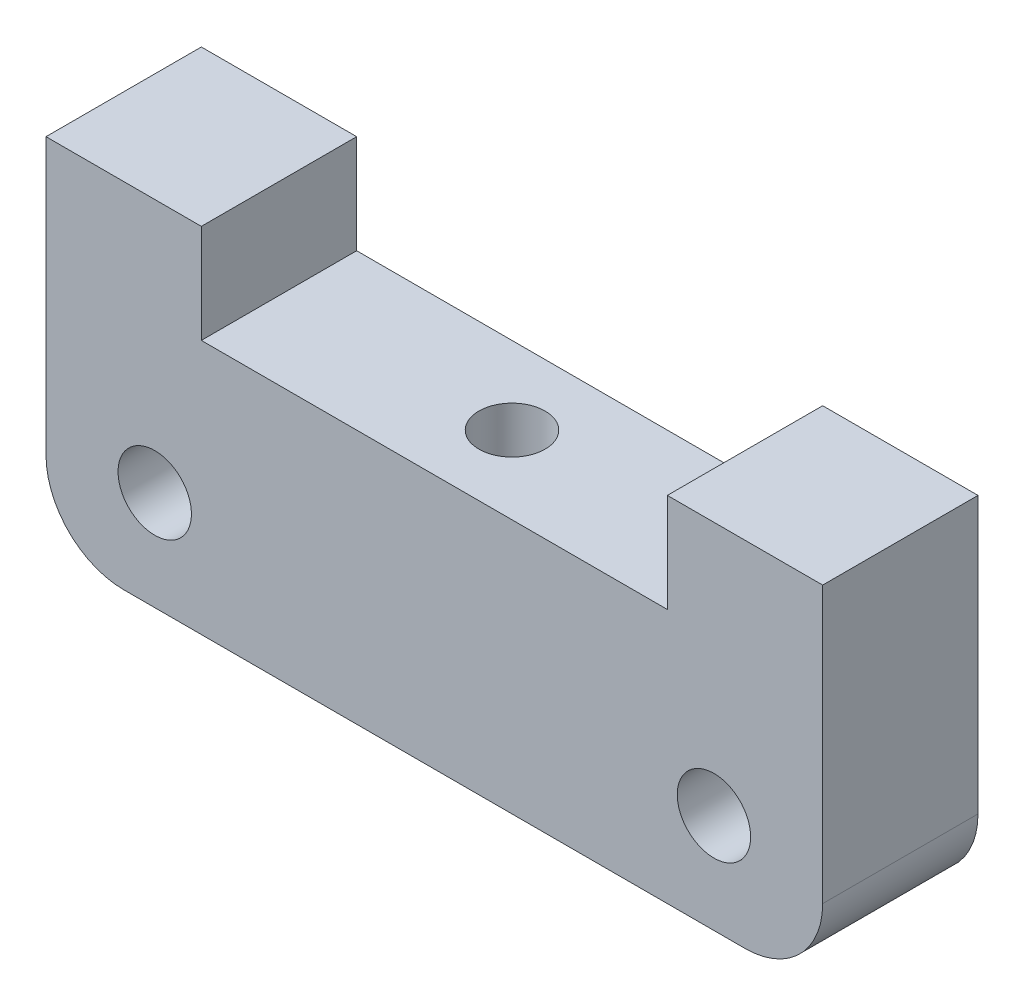
ISO-10303-21;
HEADER;
FILE_DESCRIPTION(('STEP AP214'),'2;1');
FILE_NAME('part.step','',(''),(''),'','','');
FILE_SCHEMA(('AUTOMOTIVE_DESIGN { 1 0 10303 214 1 1 1 1 }'));
ENDSEC;
DATA;
#1=APPLICATION_CONTEXT('core data for automotive mechanical design processes');
#2=APPLICATION_PROTOCOL_DEFINITION('international standard','automotive_design',2000,#1);
#3=PRODUCT_CONTEXT('',#1,'mechanical');
#4=PRODUCT('Part','Part','',(#3));
#5=PRODUCT_RELATED_PRODUCT_CATEGORY('part','',(#4));
#6=PRODUCT_DEFINITION_FORMATION('','',#4);
#7=PRODUCT_DEFINITION_CONTEXT('part definition',#1,'design');
#8=PRODUCT_DEFINITION('design','',#6,#7);
#9=PRODUCT_DEFINITION_SHAPE('','',#8);
#10=(LENGTH_UNIT() NAMED_UNIT(*) SI_UNIT(.MILLI.,.METRE.));
#11=(NAMED_UNIT(*) PLANE_ANGLE_UNIT() SI_UNIT($,.RADIAN.));
#12=(NAMED_UNIT(*) SI_UNIT($,.STERADIAN.) SOLID_ANGLE_UNIT());
#13=UNCERTAINTY_MEASURE_WITH_UNIT(LENGTH_MEASURE(1.E-05),#10,'distance_accuracy_value','');
#14=(GEOMETRIC_REPRESENTATION_CONTEXT(3) GLOBAL_UNCERTAINTY_ASSIGNED_CONTEXT((#13)) GLOBAL_UNIT_ASSIGNED_CONTEXT((#10,
#11,#12)) REPRESENTATION_CONTEXT('',''));
#15=CARTESIAN_POINT('',(0.,0.,0.));
#16=DIRECTION('',(0.,0.,1.));
#17=DIRECTION('',(1.,0.,0.));
#18=AXIS2_PLACEMENT_3D('',#15,#16,#17);
#19=CARTESIAN_POINT('',(0.,0.,6.35));
#20=DIRECTION('',(0.,0.,1.));
#21=DIRECTION('',(1.,0.,0.));
#22=AXIS2_PLACEMENT_3D('',#19,#20,#21);
#23=PLANE('',#22);
#24=DIRECTION('',(0.,1.,0.));
#25=VECTOR('',#24,1.);
#26=CARTESIAN_POINT('',(-15.875,0.,6.35));
#27=LINE('',#26,#25);
#28=CARTESIAN_POINT('',(-15.875,3.175,6.35));
#29=VERTEX_POINT('',#28);
#30=CARTESIAN_POINT('',(-15.875,14.4526,6.35));
#31=VERTEX_POINT('',#30);
#32=EDGE_CURVE('E151',#29,#31,#27,.T.);
#33=ORIENTED_EDGE('',*,*,#32,.F.);
#34=CARTESIAN_POINT('',(-12.7,3.175,6.35));
#35=DIRECTION('',(0.,0.,1.));
#36=DIRECTION('',(1.,0.,0.));
#37=AXIS2_PLACEMENT_3D('',#34,#35,#36);
#38=CIRCLE('',#37,3.175);
#39=CARTESIAN_POINT('',(-12.7,0.,6.35));
#40=VERTEX_POINT('',#39);
#41=EDGE_CURVE('E47',#29,#40,#38,.T.);
#42=ORIENTED_EDGE('',*,*,#41,.T.);
#43=DIRECTION('',(1.,0.,0.));
#44=VECTOR('',#43,1.);
#45=CARTESIAN_POINT('',(0.,0.,6.35));
#46=LINE('',#45,#44);
#47=CARTESIAN_POINT('',(12.7,0.,6.35));
#48=VERTEX_POINT('',#47);
#49=EDGE_CURVE('E177',#40,#48,#46,.T.);
#50=ORIENTED_EDGE('',*,*,#49,.T.);
#51=CARTESIAN_POINT('',(12.7,3.175,6.35));
#52=DIRECTION('',(0.,0.,1.));
#53=DIRECTION('',(1.,0.,0.));
#54=AXIS2_PLACEMENT_3D('',#51,#52,#53);
#55=CIRCLE('',#54,3.175);
#56=CARTESIAN_POINT('',(15.875,3.175,6.35));
#57=VERTEX_POINT('',#56);
#58=EDGE_CURVE('E54',#48,#57,#55,.T.);
#59=ORIENTED_EDGE('',*,*,#58,.T.);
#60=DIRECTION('',(0.,1.,0.));
#61=VECTOR('',#60,1.);
#62=CARTESIAN_POINT('',(15.875,0.,6.35));
#63=LINE('',#62,#61);
#64=CARTESIAN_POINT('',(15.875,14.4526,6.35));
#65=VERTEX_POINT('',#64);
#66=EDGE_CURVE('E180',#57,#65,#63,.T.);
#67=ORIENTED_EDGE('',*,*,#66,.T.);
#68=DIRECTION('',(-1.,0.,0.));
#69=VECTOR('',#68,1.);
#70=CARTESIAN_POINT('',(15.875,14.4526,6.35));
#71=LINE('',#70,#69);
#72=CARTESIAN_POINT('',(9.525,14.4526,6.35));
#73=VERTEX_POINT('',#72);
#74=EDGE_CURVE('E182',#65,#73,#71,.T.);
#75=ORIENTED_EDGE('',*,*,#74,.T.);
#76=DIRECTION('',(0.,-1.,0.));
#77=VECTOR('',#76,1.);
#78=CARTESIAN_POINT('',(9.525,14.4526,6.35));
#79=LINE('',#78,#77);
#80=CARTESIAN_POINT('',(9.525,10.414,6.35));
#81=VERTEX_POINT('',#80);
#82=EDGE_CURVE('E130',#73,#81,#79,.T.);
#83=ORIENTED_EDGE('',*,*,#82,.T.);
#84=DIRECTION('',(-1.,0.,0.));
#85=VECTOR('',#84,1.);
#86=CARTESIAN_POINT('',(9.525,10.414,6.35));
#87=LINE('',#86,#85);
#88=CARTESIAN_POINT('',(-9.525,10.414,6.35));
#89=VERTEX_POINT('',#88);
#90=EDGE_CURVE('E122',#81,#89,#87,.T.);
#91=ORIENTED_EDGE('',*,*,#90,.T.);
#92=DIRECTION('',(0.,-1.,0.));
#93=VECTOR('',#92,1.);
#94=CARTESIAN_POINT('',(-9.525,14.4526,6.35));
#95=LINE('',#94,#93);
#96=CARTESIAN_POINT('',(-9.525,14.4526,6.35));
#97=VERTEX_POINT('',#96);
#98=EDGE_CURVE('E127',#97,#89,#95,.T.);
#99=ORIENTED_EDGE('',*,*,#98,.F.);
#100=DIRECTION('',(1.,0.,0.));
#101=VECTOR('',#100,1.);
#102=CARTESIAN_POINT('',(-15.875,14.4526,6.35));
#103=LINE('',#102,#101);
#104=EDGE_CURVE('E148',#31,#97,#103,.T.);
#105=ORIENTED_EDGE('',*,*,#104,.F.);
#106=EDGE_LOOP('',(#33,#42,#50,#59,#67,#75,#83,#91,#99,#105));
#107=FACE_BOUND('',#106,.T.);
#108=CARTESIAN_POINT('',(11.43,4.064,6.35));
#109=DIRECTION('',(0.,0.,1.));
#110=DIRECTION('',(1.,0.,0.));
#111=AXIS2_PLACEMENT_3D('',#108,#109,#110);
#112=CIRCLE('',#111,1.5);
#113=CARTESIAN_POINT('',(12.93,4.064,6.35));
#114=VERTEX_POINT('',#113);
#115=EDGE_CURVE('E169',#114,#114,#112,.T.);
#116=ORIENTED_EDGE('',*,*,#115,.F.);
#117=EDGE_LOOP('',(#116));
#118=FACE_BOUND('',#117,.T.);
#119=CARTESIAN_POINT('',(-11.43,4.064,6.35));
#120=DIRECTION('',(0.,0.,-1.));
#121=DIRECTION('',(-1.,0.,0.));
#122=AXIS2_PLACEMENT_3D('',#119,#120,#121);
#123=CIRCLE('',#122,1.5);
#124=CARTESIAN_POINT('',(-12.93,4.064,6.35));
#125=VERTEX_POINT('',#124);
#126=EDGE_CURVE('E163',#125,#125,#123,.T.);
#127=ORIENTED_EDGE('',*,*,#126,.T.);
#128=EDGE_LOOP('',(#127));
#129=FACE_BOUND('',#128,.T.);
#130=ADVANCED_FACE('F38',(#107,#118,#129),#23,.T.);
#131=CARTESIAN_POINT('',(0.,0.,0.));
#132=DIRECTION('',(0.,0.,1.));
#133=DIRECTION('',(1.,0.,0.));
#134=AXIS2_PLACEMENT_3D('',#131,#132,#133);
#135=PLANE('',#134);
#136=DIRECTION('',(1.,0.,0.));
#137=VECTOR('',#136,1.);
#138=CARTESIAN_POINT('',(0.,0.,0.));
#139=LINE('',#138,#137);
#140=CARTESIAN_POINT('',(-12.7,0.,0.));
#141=VERTEX_POINT('',#140);
#142=CARTESIAN_POINT('',(12.7,0.,0.));
#143=VERTEX_POINT('',#142);
#144=EDGE_CURVE('E173',#141,#143,#139,.T.);
#145=ORIENTED_EDGE('',*,*,#144,.F.);
#146=CARTESIAN_POINT('',(-12.7,3.175,0.));
#147=DIRECTION('',(0.,0.,1.));
#148=DIRECTION('',(1.,0.,0.));
#149=AXIS2_PLACEMENT_3D('',#146,#147,#148);
#150=CIRCLE('',#149,3.175);
#151=CARTESIAN_POINT('',(-15.875,3.175,0.));
#152=VERTEX_POINT('',#151);
#153=EDGE_CURVE('E220',#141,#152,#150,.F.);
#154=ORIENTED_EDGE('',*,*,#153,.T.);
#155=DIRECTION('',(0.,1.,0.));
#156=VECTOR('',#155,1.);
#157=CARTESIAN_POINT('',(-15.875,0.,0.));
#158=LINE('',#157,#156);
#159=CARTESIAN_POINT('',(-15.875,14.4526,0.));
#160=VERTEX_POINT('',#159);
#161=EDGE_CURVE('E149',#152,#160,#158,.T.);
#162=ORIENTED_EDGE('',*,*,#161,.T.);
#163=DIRECTION('',(1.,0.,0.));
#164=VECTOR('',#163,1.);
#165=CARTESIAN_POINT('',(-15.875,14.4526,0.));
#166=LINE('',#165,#164);
#167=CARTESIAN_POINT('',(-9.525,14.4526,0.));
#168=VERTEX_POINT('',#167);
#169=EDGE_CURVE('E153',#160,#168,#166,.T.);
#170=ORIENTED_EDGE('',*,*,#169,.T.);
#171=DIRECTION('',(0.,-1.,0.));
#172=VECTOR('',#171,1.);
#173=CARTESIAN_POINT('',(-9.525,14.4526,0.));
#174=LINE('',#173,#172);
#175=CARTESIAN_POINT('',(-9.525,10.414,0.));
#176=VERTEX_POINT('',#175);
#177=EDGE_CURVE('E161',#168,#176,#174,.T.);
#178=ORIENTED_EDGE('',*,*,#177,.T.);
#179=DIRECTION('',(-1.,0.,0.));
#180=VECTOR('',#179,1.);
#181=CARTESIAN_POINT('',(9.525,10.414,0.));
#182=LINE('',#181,#180);
#183=CARTESIAN_POINT('',(9.525,10.414,0.));
#184=VERTEX_POINT('',#183);
#185=EDGE_CURVE('E140',#184,#176,#182,.T.);
#186=ORIENTED_EDGE('',*,*,#185,.F.);
#187=DIRECTION('',(0.,-1.,0.));
#188=VECTOR('',#187,1.);
#189=CARTESIAN_POINT('',(9.525,14.4526,0.));
#190=LINE('',#189,#188);
#191=CARTESIAN_POINT('',(9.525,14.4526,0.));
#192=VERTEX_POINT('',#191);
#193=EDGE_CURVE('E193',#192,#184,#190,.T.);
#194=ORIENTED_EDGE('',*,*,#193,.F.);
#195=DIRECTION('',(-1.,0.,0.));
#196=VECTOR('',#195,1.);
#197=CARTESIAN_POINT('',(15.875,14.4526,0.));
#198=LINE('',#197,#196);
#199=CARTESIAN_POINT('',(15.875,14.4526,0.));
#200=VERTEX_POINT('',#199);
#201=EDGE_CURVE('E191',#200,#192,#198,.T.);
#202=ORIENTED_EDGE('',*,*,#201,.F.);
#203=DIRECTION('',(0.,1.,0.));
#204=VECTOR('',#203,1.);
#205=CARTESIAN_POINT('',(15.875,0.,0.));
#206=LINE('',#205,#204);
#207=CARTESIAN_POINT('',(15.875,3.175,0.));
#208=VERTEX_POINT('',#207);
#209=EDGE_CURVE('E188',#208,#200,#206,.T.);
#210=ORIENTED_EDGE('',*,*,#209,.F.);
#211=CARTESIAN_POINT('',(12.7,3.175,0.));
#212=DIRECTION('',(0.,0.,1.));
#213=DIRECTION('',(1.,0.,0.));
#214=AXIS2_PLACEMENT_3D('',#211,#212,#213);
#215=CIRCLE('',#214,3.175);
#216=EDGE_CURVE('E217',#208,#143,#215,.F.);
#217=ORIENTED_EDGE('',*,*,#216,.T.);
#218=EDGE_LOOP('',(#145,#154,#162,#170,#178,#186,#194,#202,#210,#217));
#219=FACE_BOUND('',#218,.T.);
#220=CARTESIAN_POINT('',(11.43,4.064,0.));
#221=DIRECTION('',(0.,0.,1.));
#222=DIRECTION('',(1.,0.,0.));
#223=AXIS2_PLACEMENT_3D('',#220,#221,#222);
#224=CIRCLE('',#223,1.5);
#225=CARTESIAN_POINT('',(12.93,4.064,0.));
#226=VERTEX_POINT('',#225);
#227=EDGE_CURVE('E144',#226,#226,#224,.T.);
#228=ORIENTED_EDGE('',*,*,#227,.T.);
#229=EDGE_LOOP('',(#228));
#230=FACE_BOUND('',#229,.T.);
#231=CARTESIAN_POINT('',(-11.43,4.064,0.));
#232=DIRECTION('',(0.,0.,-1.));
#233=DIRECTION('',(-1.,0.,0.));
#234=AXIS2_PLACEMENT_3D('',#231,#232,#233);
#235=CIRCLE('',#234,1.5);
#236=CARTESIAN_POINT('',(-12.93,4.064,0.));
#237=VERTEX_POINT('',#236);
#238=EDGE_CURVE('E156',#237,#237,#235,.T.);
#239=ORIENTED_EDGE('',*,*,#238,.F.);
#240=EDGE_LOOP('',(#239));
#241=FACE_BOUND('',#240,.T.);
#242=ADVANCED_FACE('F236',(#219,#230,#241),#135,.F.);
#243=CARTESIAN_POINT('',(0.,0.,6.35));
#244=DIRECTION('',(0.,1.,0.));
#245=DIRECTION('',(0.,0.,1.));
#246=AXIS2_PLACEMENT_3D('',#243,#244,#245);
#247=PLANE('',#246);
#248=CARTESIAN_POINT('',(0.,0.,3.175));
#249=DIRECTION('',(0.,-1.,0.));
#250=DIRECTION('',(0.,0.,-1.));
#251=AXIS2_PLACEMENT_3D('',#248,#249,#250);
#252=CIRCLE('',#251,1.35255);
#253=CARTESIAN_POINT('',(0.,0.,1.82245));
#254=VERTEX_POINT('',#253);
#255=EDGE_CURVE('E210',#254,#254,#252,.T.);
#256=ORIENTED_EDGE('',*,*,#255,.F.);
#257=EDGE_LOOP('',(#256));
#258=FACE_BOUND('',#257,.T.);
#259=ORIENTED_EDGE('',*,*,#49,.F.);
#260=DIRECTION('',(0.,0.,-1.));
#261=VECTOR('',#260,1.);
#262=CARTESIAN_POINT('',(-12.7,0.,0.));
#263=LINE('',#262,#261);
#264=EDGE_CURVE('E213',#40,#141,#263,.T.);
#265=ORIENTED_EDGE('',*,*,#264,.T.);
#266=ORIENTED_EDGE('',*,*,#144,.T.);
#267=DIRECTION('',(0.,0.,-1.));
#268=VECTOR('',#267,1.);
#269=CARTESIAN_POINT('',(12.7,0.,6.35));
#270=LINE('',#269,#268);
#271=EDGE_CURVE('E206',#143,#48,#270,.F.);
#272=ORIENTED_EDGE('',*,*,#271,.T.);
#273=EDGE_LOOP('',(#259,#265,#266,#272));
#274=FACE_BOUND('',#273,.T.);
#275=ADVANCED_FACE('F231',(#258,#274),#247,.F.);
#276=CARTESIAN_POINT('',(15.875,0.,6.35));
#277=DIRECTION('',(-1.,0.,0.));
#278=DIRECTION('',(0.,0.,1.));
#279=AXIS2_PLACEMENT_3D('',#276,#277,#278);
#280=PLANE('',#279);
#281=ORIENTED_EDGE('',*,*,#66,.F.);
#282=DIRECTION('',(0.,0.,-1.));
#283=VECTOR('',#282,1.);
#284=CARTESIAN_POINT('',(15.875,3.175,6.35));
#285=LINE('',#284,#283);
#286=EDGE_CURVE('E11',#57,#208,#285,.T.);
#287=ORIENTED_EDGE('',*,*,#286,.T.);
#288=ORIENTED_EDGE('',*,*,#209,.T.);
#289=DIRECTION('',(0.,0.,-1.));
#290=VECTOR('',#289,1.);
#291=CARTESIAN_POINT('',(15.875,14.4526,6.35));
#292=LINE('',#291,#290);
#293=EDGE_CURVE('E203',#65,#200,#292,.T.);
#294=ORIENTED_EDGE('',*,*,#293,.F.);
#295=EDGE_LOOP('',(#281,#287,#288,#294));
#296=FACE_BOUND('',#295,.T.);
#297=ADVANCED_FACE('F254',(#296),#280,.F.);
#298=CARTESIAN_POINT('',(15.875,14.4526,6.35));
#299=DIRECTION('',(0.,-1.,0.));
#300=DIRECTION('',(0.,0.,-1.));
#301=AXIS2_PLACEMENT_3D('',#298,#299,#300);
#302=PLANE('',#301);
#303=ORIENTED_EDGE('',*,*,#201,.T.);
#304=DIRECTION('',(0.,0.,-1.));
#305=VECTOR('',#304,1.);
#306=CARTESIAN_POINT('',(9.525,14.4526,6.35));
#307=LINE('',#306,#305);
#308=EDGE_CURVE('E200',#73,#192,#307,.T.);
#309=ORIENTED_EDGE('',*,*,#308,.F.);
#310=ORIENTED_EDGE('',*,*,#74,.F.);
#311=ORIENTED_EDGE('',*,*,#293,.T.);
#312=EDGE_LOOP('',(#303,#309,#310,#311));
#313=FACE_BOUND('',#312,.T.);
#314=ADVANCED_FACE('F251',(#313),#302,.F.);
#315=CARTESIAN_POINT('',(9.525,14.4526,6.35));
#316=DIRECTION('',(1.,0.,0.));
#317=DIRECTION('',(0.,0.,-1.));
#318=AXIS2_PLACEMENT_3D('',#315,#316,#317);
#319=PLANE('',#318);
#320=ORIENTED_EDGE('',*,*,#193,.T.);
#321=DIRECTION('',(0.,0.,-1.));
#322=VECTOR('',#321,1.);
#323=CARTESIAN_POINT('',(9.525,10.414,6.35));
#324=LINE('',#323,#322);
#325=EDGE_CURVE('E134',#81,#184,#324,.T.);
#326=ORIENTED_EDGE('',*,*,#325,.F.);
#327=ORIENTED_EDGE('',*,*,#82,.F.);
#328=ORIENTED_EDGE('',*,*,#308,.T.);
#329=EDGE_LOOP('',(#320,#326,#327,#328));
#330=FACE_BOUND('',#329,.T.);
#331=ADVANCED_FACE('F247',(#330),#319,.F.);
#332=CARTESIAN_POINT('',(9.525,10.414,6.35));
#333=DIRECTION('',(0.,-1.,0.));
#334=DIRECTION('',(0.,0.,-1.));
#335=AXIS2_PLACEMENT_3D('',#332,#333,#334);
#336=PLANE('',#335);
#337=CARTESIAN_POINT('',(0.,10.414,3.175));
#338=DIRECTION('',(0.,-1.,0.));
#339=DIRECTION('',(0.,0.,-1.));
#340=AXIS2_PLACEMENT_3D('',#337,#338,#339);
#341=CIRCLE('',#340,1.35255);
#342=CARTESIAN_POINT('',(0.,10.414,1.82245));
#343=VERTEX_POINT('',#342);
#344=EDGE_CURVE('E207',#343,#343,#341,.T.);
#345=ORIENTED_EDGE('',*,*,#344,.T.);
#346=EDGE_LOOP('',(#345));
#347=FACE_BOUND('',#346,.T.);
#348=ORIENTED_EDGE('',*,*,#185,.T.);
#349=DIRECTION('',(0.,0.,-1.));
#350=VECTOR('',#349,1.);
#351=CARTESIAN_POINT('',(-9.525,10.414,6.35));
#352=LINE('',#351,#350);
#353=EDGE_CURVE('E137',#89,#176,#352,.T.);
#354=ORIENTED_EDGE('',*,*,#353,.F.);
#355=ORIENTED_EDGE('',*,*,#90,.F.);
#356=ORIENTED_EDGE('',*,*,#325,.T.);
#357=EDGE_LOOP('',(#348,#354,#355,#356));
#358=FACE_BOUND('',#357,.T.);
#359=ADVANCED_FACE('F138',(#347,#358),#336,.F.);
#360=CARTESIAN_POINT('',(11.43,4.064,6.35));
#361=DIRECTION('',(0.,0.,-1.));
#362=DIRECTION('',(-1.,0.,0.));
#363=AXIS2_PLACEMENT_3D('',#360,#361,#362);
#364=CYLINDRICAL_SURFACE('',#363,1.5);
#365=ORIENTED_EDGE('',*,*,#115,.T.);
#366=EDGE_LOOP('',(#365));
#367=FACE_BOUND('',#366,.T.);
#368=ORIENTED_EDGE('',*,*,#227,.F.);
#369=EDGE_LOOP('',(#368));
#370=FACE_BOUND('',#369,.T.);
#371=ADVANCED_FACE('F269',(#367,#370),#364,.F.);
#372=CARTESIAN_POINT('',(-9.525,14.4526,6.35));
#373=DIRECTION('',(1.,0.,0.));
#374=DIRECTION('',(0.,1.,0.));
#375=AXIS2_PLACEMENT_3D('',#372,#373,#374);
#376=PLANE('',#375);
#377=ORIENTED_EDGE('',*,*,#177,.F.);
#378=DIRECTION('',(0.,0.,-1.));
#379=VECTOR('',#378,1.);
#380=CARTESIAN_POINT('',(-9.525,14.4526,6.35));
#381=LINE('',#380,#379);
#382=EDGE_CURVE('E145',#97,#168,#381,.T.);
#383=ORIENTED_EDGE('',*,*,#382,.F.);
#384=ORIENTED_EDGE('',*,*,#98,.T.);
#385=ORIENTED_EDGE('',*,*,#353,.T.);
#386=EDGE_LOOP('',(#377,#383,#384,#385));
#387=FACE_BOUND('',#386,.T.);
#388=ADVANCED_FACE('F147',(#387),#376,.T.);
#389=CARTESIAN_POINT('',(-15.875,14.4526,6.35));
#390=DIRECTION('',(0.,1.,0.));
#391=DIRECTION('',(-1.,0.,0.));
#392=AXIS2_PLACEMENT_3D('',#389,#390,#391);
#393=PLANE('',#392);
#394=ORIENTED_EDGE('',*,*,#169,.F.);
#395=DIRECTION('',(0.,0.,-1.));
#396=VECTOR('',#395,1.);
#397=CARTESIAN_POINT('',(-15.875,14.4526,6.35));
#398=LINE('',#397,#396);
#399=EDGE_CURVE('E160',#31,#160,#398,.T.);
#400=ORIENTED_EDGE('',*,*,#399,.F.);
#401=ORIENTED_EDGE('',*,*,#104,.T.);
#402=ORIENTED_EDGE('',*,*,#382,.T.);
#403=EDGE_LOOP('',(#394,#400,#401,#402));
#404=FACE_BOUND('',#403,.T.);
#405=ADVANCED_FACE('F242',(#404),#393,.T.);
#406=CARTESIAN_POINT('',(-15.875,0.,6.35));
#407=DIRECTION('',(-1.,0.,0.));
#408=DIRECTION('',(0.,-1.,0.));
#409=AXIS2_PLACEMENT_3D('',#406,#407,#408);
#410=PLANE('',#409);
#411=ORIENTED_EDGE('',*,*,#161,.F.);
#412=DIRECTION('',(0.,0.,-1.));
#413=VECTOR('',#412,1.);
#414=CARTESIAN_POINT('',(-15.875,3.175,6.35));
#415=LINE('',#414,#413);
#416=EDGE_CURVE('E62',#152,#29,#415,.F.);
#417=ORIENTED_EDGE('',*,*,#416,.T.);
#418=ORIENTED_EDGE('',*,*,#32,.T.);
#419=ORIENTED_EDGE('',*,*,#399,.T.);
#420=EDGE_LOOP('',(#411,#417,#418,#419));
#421=FACE_BOUND('',#420,.T.);
#422=ADVANCED_FACE('F238',(#421),#410,.T.);
#423=CARTESIAN_POINT('',(-11.43,4.064,6.35));
#424=DIRECTION('',(0.,0.,-1.));
#425=DIRECTION('',(-1.,0.,0.));
#426=AXIS2_PLACEMENT_3D('',#423,#424,#425);
#427=CYLINDRICAL_SURFACE('',#426,1.5);
#428=ORIENTED_EDGE('',*,*,#126,.F.);
#429=EDGE_LOOP('',(#428));
#430=FACE_BOUND('',#429,.T.);
#431=ORIENTED_EDGE('',*,*,#238,.T.);
#432=EDGE_LOOP('',(#431));
#433=FACE_BOUND('',#432,.T.);
#434=ADVANCED_FACE('F296',(#430,#433),#427,.F.);
#435=CARTESIAN_POINT('',(0.,14.4526,3.175));
#436=DIRECTION('',(0.,-1.,0.));
#437=DIRECTION('',(0.,0.,-1.));
#438=AXIS2_PLACEMENT_3D('',#435,#436,#437);
#439=CYLINDRICAL_SURFACE('',#438,1.35255);
#440=ORIENTED_EDGE('',*,*,#255,.T.);
#441=EDGE_LOOP('',(#440));
#442=FACE_BOUND('',#441,.T.);
#443=ORIENTED_EDGE('',*,*,#344,.F.);
#444=EDGE_LOOP('',(#443));
#445=FACE_BOUND('',#444,.T.);
#446=ADVANCED_FACE('F261',(#442,#445),#439,.F.);
#447=CARTESIAN_POINT('',(-12.7,3.175,6.35));
#448=DIRECTION('',(0.,0.,1.));
#449=DIRECTION('',(1.,0.,0.));
#450=AXIS2_PLACEMENT_3D('',#447,#448,#449);
#451=CYLINDRICAL_SURFACE('',#450,3.175);
#452=ORIENTED_EDGE('',*,*,#41,.F.);
#453=ORIENTED_EDGE('',*,*,#416,.F.);
#454=ORIENTED_EDGE('',*,*,#153,.F.);
#455=ORIENTED_EDGE('',*,*,#264,.F.);
#456=EDGE_LOOP('',(#452,#453,#454,#455));
#457=FACE_BOUND('',#456,.T.);
#458=ADVANCED_FACE('F234',(#457),#451,.T.);
#459=CARTESIAN_POINT('',(12.7,3.175,6.35));
#460=DIRECTION('',(0.,0.,-1.));
#461=DIRECTION('',(-1.,0.,0.));
#462=AXIS2_PLACEMENT_3D('',#459,#460,#461);
#463=CYLINDRICAL_SURFACE('',#462,3.175);
#464=ORIENTED_EDGE('',*,*,#58,.F.);
#465=ORIENTED_EDGE('',*,*,#271,.F.);
#466=ORIENTED_EDGE('',*,*,#216,.F.);
#467=ORIENTED_EDGE('',*,*,#286,.F.);
#468=EDGE_LOOP('',(#464,#465,#466,#467));
#469=FACE_BOUND('',#468,.T.);
#470=ADVANCED_FACE('F40',(#469),#463,.T.);
#471=CLOSED_SHELL('',(#130,#242,#275,#297,#314,#331,#359,#371,#388,#405,#422,#434,#446,#458,#470));
#472=MANIFOLD_SOLID_BREP('B2',#471);
#473=ADVANCED_BREP_SHAPE_REPRESENTATION('',(#18,#472),#14);
#474=SHAPE_DEFINITION_REPRESENTATION(#9,#473);
ENDSEC;
END-ISO-10303-21;
